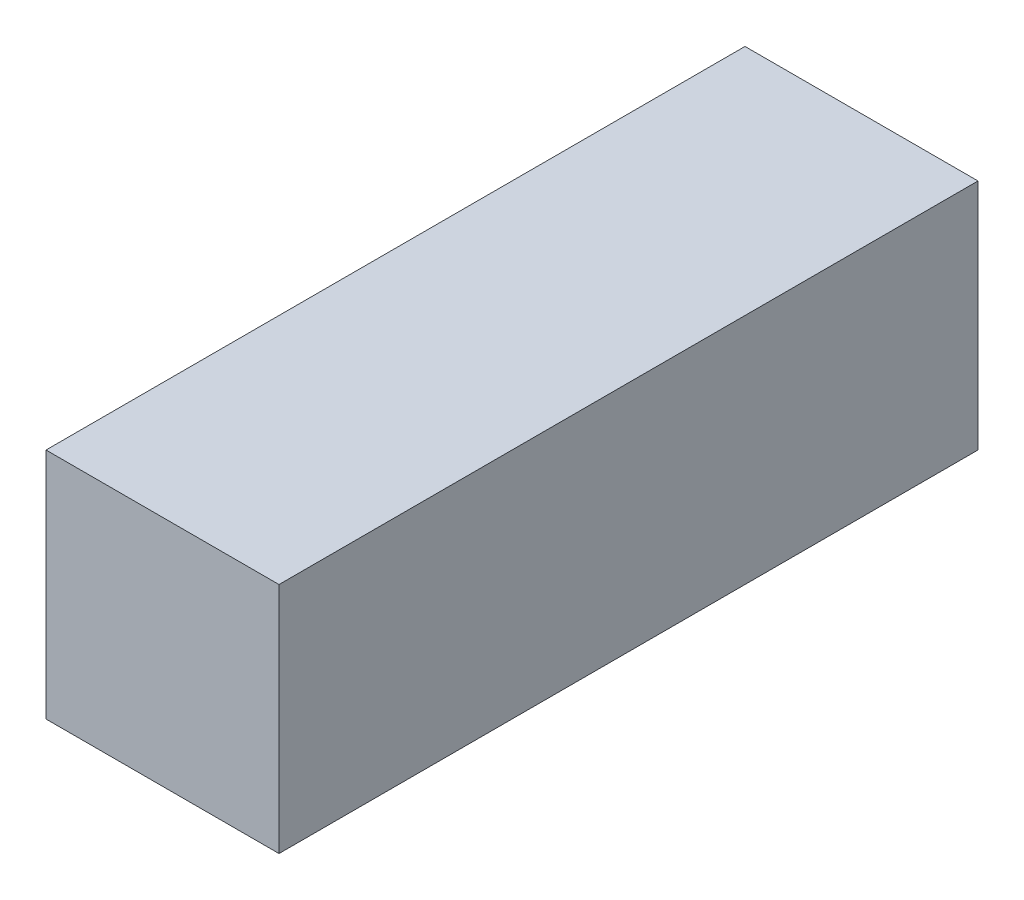
ISO-10303-21;
HEADER;
FILE_DESCRIPTION(('STEP AP214'),'2;1');
FILE_NAME('part.step','',(''),(''),'','','');
FILE_SCHEMA(('AUTOMOTIVE_DESIGN { 1 0 10303 214 1 1 1 1 }'));
ENDSEC;
DATA;
#1=APPLICATION_CONTEXT('core data for automotive mechanical design processes');
#2=APPLICATION_PROTOCOL_DEFINITION('international standard','automotive_design',2000,#1);
#3=PRODUCT_CONTEXT('',#1,'mechanical');
#4=PRODUCT('Part','Part','',(#3));
#5=PRODUCT_RELATED_PRODUCT_CATEGORY('part','',(#4));
#6=PRODUCT_DEFINITION_FORMATION('','',#4);
#7=PRODUCT_DEFINITION_CONTEXT('part definition',#1,'design');
#8=PRODUCT_DEFINITION('design','',#6,#7);
#9=PRODUCT_DEFINITION_SHAPE('','',#8);
#10=(LENGTH_UNIT() NAMED_UNIT(*) SI_UNIT(.MILLI.,.METRE.));
#11=(NAMED_UNIT(*) PLANE_ANGLE_UNIT() SI_UNIT($,.RADIAN.));
#12=(NAMED_UNIT(*) SI_UNIT($,.STERADIAN.) SOLID_ANGLE_UNIT());
#13=UNCERTAINTY_MEASURE_WITH_UNIT(LENGTH_MEASURE(1.E-05),#10,'distance_accuracy_value','');
#14=(GEOMETRIC_REPRESENTATION_CONTEXT(3) GLOBAL_UNCERTAINTY_ASSIGNED_CONTEXT((#13)) GLOBAL_UNIT_ASSIGNED_CONTEXT((#10,
#11,#12)) REPRESENTATION_CONTEXT('',''));
#15=CARTESIAN_POINT('',(0.,0.,0.));
#16=DIRECTION('',(0.,0.,1.));
#17=DIRECTION('',(1.,0.,0.));
#18=AXIS2_PLACEMENT_3D('',#15,#16,#17);
#19=CARTESIAN_POINT('',(-57.5041571107131,200.,-259.038134660862));
#20=DIRECTION('',(1.,0.,0.));
#21=DIRECTION('',(0.,0.,-1.));
#22=AXIS2_PLACEMENT_3D('',#19,#20,#21);
#23=PLANE('',#22);
#24=DIRECTION('',(0.,0.,1.));
#25=VECTOR('',#24,1.);
#26=CARTESIAN_POINT('',(-57.5041571107131,0.,-259.038134660862));
#27=LINE('',#26,#25);
#28=CARTESIAN_POINT('',(-57.5041571107131,0.,-259.038134660862));
#29=VERTEX_POINT('',#28);
#30=CARTESIAN_POINT('',(-57.504157110713,0.,340.961865339138));
#31=VERTEX_POINT('',#30);
#32=EDGE_CURVE('E100',#29,#31,#27,.T.);
#33=ORIENTED_EDGE('',*,*,#32,.T.);
#34=DIRECTION('',(0.,-1.,0.));
#35=VECTOR('',#34,1.);
#36=CARTESIAN_POINT('',(-57.504157110713,200.,340.961865339138));
#37=LINE('',#36,#35);
#38=CARTESIAN_POINT('',(-57.504157110713,200.,340.961865339138));
#39=VERTEX_POINT('',#38);
#40=EDGE_CURVE('E11',#39,#31,#37,.T.);
#41=ORIENTED_EDGE('',*,*,#40,.F.);
#42=DIRECTION('',(0.,0.,1.));
#43=VECTOR('',#42,1.);
#44=CARTESIAN_POINT('',(-57.5041571107131,200.,-259.038134660862));
#45=LINE('',#44,#43);
#46=CARTESIAN_POINT('',(-57.5041571107131,200.,-259.038134660862));
#47=VERTEX_POINT('',#46);
#48=EDGE_CURVE('E88',#47,#39,#45,.T.);
#49=ORIENTED_EDGE('',*,*,#48,.F.);
#50=DIRECTION('',(0.,-1.,0.));
#51=VECTOR('',#50,1.);
#52=CARTESIAN_POINT('',(-57.5041571107131,200.,-259.038134660862));
#53=LINE('',#52,#51);
#54=EDGE_CURVE('E96',#47,#29,#53,.T.);
#55=ORIENTED_EDGE('',*,*,#54,.T.);
#56=EDGE_LOOP('',(#33,#41,#49,#55));
#57=FACE_BOUND('',#56,.T.);
#58=ADVANCED_FACE('F37',(#57),#23,.F.);
#59=CARTESIAN_POINT('',(-57.504157110713,200.,340.961865339138));
#60=DIRECTION('',(0.,0.,-1.));
#61=DIRECTION('',(-1.,0.,0.));
#62=AXIS2_PLACEMENT_3D('',#59,#60,#61);
#63=PLANE('',#62);
#64=DIRECTION('',(1.,0.,0.));
#65=VECTOR('',#64,1.);
#66=CARTESIAN_POINT('',(-57.504157110713,0.,340.961865339138));
#67=LINE('',#66,#65);
#68=CARTESIAN_POINT('',(142.495842889287,0.,340.961865339138));
#69=VERTEX_POINT('',#68);
#70=EDGE_CURVE('E92',#31,#69,#67,.T.);
#71=ORIENTED_EDGE('',*,*,#70,.T.);
#72=DIRECTION('',(0.,-1.,0.));
#73=VECTOR('',#72,1.);
#74=CARTESIAN_POINT('',(142.495842889287,200.,340.961865339138));
#75=LINE('',#74,#73);
#76=CARTESIAN_POINT('',(142.495842889287,200.,340.961865339138));
#77=VERTEX_POINT('',#76);
#78=EDGE_CURVE('E45',#77,#69,#75,.T.);
#79=ORIENTED_EDGE('',*,*,#78,.F.);
#80=DIRECTION('',(1.,0.,0.));
#81=VECTOR('',#80,1.);
#82=CARTESIAN_POINT('',(-57.504157110713,200.,340.961865339138));
#83=LINE('',#82,#81);
#84=EDGE_CURVE('E83',#39,#77,#83,.T.);
#85=ORIENTED_EDGE('',*,*,#84,.F.);
#86=ORIENTED_EDGE('',*,*,#40,.T.);
#87=EDGE_LOOP('',(#71,#79,#85,#86));
#88=FACE_BOUND('',#87,.T.);
#89=ADVANCED_FACE('F91',(#88),#63,.F.);
#90=CARTESIAN_POINT('',(142.495842889287,200.,-259.038134660862));
#91=DIRECTION('',(-1.,0.,0.));
#92=DIRECTION('',(0.,0.,1.));
#93=AXIS2_PLACEMENT_3D('',#90,#91,#92);
#94=PLANE('',#93);
#95=DIRECTION('',(0.,0.,-1.));
#96=VECTOR('',#95,1.);
#97=CARTESIAN_POINT('',(142.495842889287,0.,-259.038134660862));
#98=LINE('',#97,#96);
#99=CARTESIAN_POINT('',(142.495842889287,0.,-259.038134660862));
#100=VERTEX_POINT('',#99);
#101=EDGE_CURVE('E70',#69,#100,#98,.T.);
#102=ORIENTED_EDGE('',*,*,#101,.T.);
#103=DIRECTION('',(0.,-1.,0.));
#104=VECTOR('',#103,1.);
#105=CARTESIAN_POINT('',(142.495842889287,200.,-259.038134660862));
#106=LINE('',#105,#104);
#107=CARTESIAN_POINT('',(142.495842889287,200.,-259.038134660862));
#108=VERTEX_POINT('',#107);
#109=EDGE_CURVE('E93',#108,#100,#106,.T.);
#110=ORIENTED_EDGE('',*,*,#109,.F.);
#111=DIRECTION('',(0.,0.,-1.));
#112=VECTOR('',#111,1.);
#113=CARTESIAN_POINT('',(142.495842889287,200.,-259.038134660862));
#114=LINE('',#113,#112);
#115=EDGE_CURVE('E86',#77,#108,#114,.T.);
#116=ORIENTED_EDGE('',*,*,#115,.F.);
#117=ORIENTED_EDGE('',*,*,#78,.T.);
#118=EDGE_LOOP('',(#102,#110,#116,#117));
#119=FACE_BOUND('',#118,.T.);
#120=ADVANCED_FACE('F94',(#119),#94,.F.);
#121=CARTESIAN_POINT('',(-57.5041571107131,200.,-259.038134660862));
#122=DIRECTION('',(0.,0.,1.));
#123=DIRECTION('',(1.,0.,0.));
#124=AXIS2_PLACEMENT_3D('',#121,#122,#123);
#125=PLANE('',#124);
#126=DIRECTION('',(-1.,0.,0.));
#127=VECTOR('',#126,1.);
#128=CARTESIAN_POINT('',(-57.5041571107131,0.,-259.038134660862));
#129=LINE('',#128,#127);
#130=EDGE_CURVE('E76',#100,#29,#129,.T.);
#131=ORIENTED_EDGE('',*,*,#130,.T.);
#132=ORIENTED_EDGE('',*,*,#54,.F.);
#133=DIRECTION('',(-1.,0.,0.));
#134=VECTOR('',#133,1.);
#135=CARTESIAN_POINT('',(-57.5041571107131,200.,-259.038134660862));
#136=LINE('',#135,#134);
#137=EDGE_CURVE('E53',#108,#47,#136,.T.);
#138=ORIENTED_EDGE('',*,*,#137,.F.);
#139=ORIENTED_EDGE('',*,*,#109,.T.);
#140=EDGE_LOOP('',(#131,#132,#138,#139));
#141=FACE_BOUND('',#140,.T.);
#142=ADVANCED_FACE('F107',(#141),#125,.F.);
#143=CARTESIAN_POINT('',(0.,200.,0.));
#144=DIRECTION('',(0.,1.,0.));
#145=DIRECTION('',(0.,0.,1.));
#146=AXIS2_PLACEMENT_3D('',#143,#144,#145);
#147=PLANE('',#146);
#148=ORIENTED_EDGE('',*,*,#48,.T.);
#149=ORIENTED_EDGE('',*,*,#84,.T.);
#150=ORIENTED_EDGE('',*,*,#115,.T.);
#151=ORIENTED_EDGE('',*,*,#137,.T.);
#152=EDGE_LOOP('',(#148,#149,#150,#151));
#153=FACE_BOUND('',#152,.T.);
#154=ADVANCED_FACE('F84',(#153),#147,.T.);
#155=CARTESIAN_POINT('',(0.,0.,0.));
#156=DIRECTION('',(0.,1.,0.));
#157=DIRECTION('',(0.,0.,1.));
#158=AXIS2_PLACEMENT_3D('',#155,#156,#157);
#159=PLANE('',#158);
#160=ORIENTED_EDGE('',*,*,#32,.F.);
#161=ORIENTED_EDGE('',*,*,#130,.F.);
#162=ORIENTED_EDGE('',*,*,#101,.F.);
#163=ORIENTED_EDGE('',*,*,#70,.F.);
#164=EDGE_LOOP('',(#160,#161,#162,#163));
#165=FACE_BOUND('',#164,.T.);
#166=ADVANCED_FACE('F110',(#165),#159,.F.);
#167=CLOSED_SHELL('',(#58,#89,#120,#142,#154,#166));
#168=MANIFOLD_SOLID_BREP('B2',#167);
#169=ADVANCED_BREP_SHAPE_REPRESENTATION('',(#18,#168),#14);
#170=SHAPE_DEFINITION_REPRESENTATION(#9,#169);
ENDSEC;
END-ISO-10303-21;
